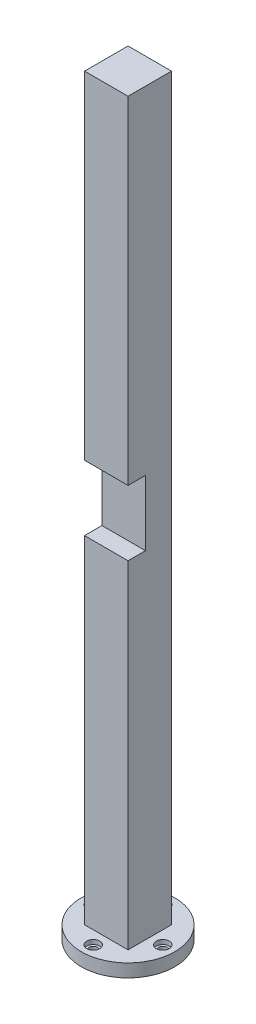
ISO-10303-21;
HEADER;
FILE_DESCRIPTION(('STEP AP214'),'2;1');
FILE_NAME('part.step','',(''),(''),'','','');
FILE_SCHEMA(('AUTOMOTIVE_DESIGN { 1 0 10303 214 1 1 1 1 }'));
ENDSEC;
DATA;
#1=APPLICATION_CONTEXT('core data for automotive mechanical design processes');
#2=APPLICATION_PROTOCOL_DEFINITION('international standard','automotive_design',2000,#1);
#3=PRODUCT_CONTEXT('',#1,'mechanical');
#4=PRODUCT('Part','Part','',(#3));
#5=PRODUCT_RELATED_PRODUCT_CATEGORY('part','',(#4));
#6=PRODUCT_DEFINITION_FORMATION('','',#4);
#7=PRODUCT_DEFINITION_CONTEXT('part definition',#1,'design');
#8=PRODUCT_DEFINITION('design','',#6,#7);
#9=PRODUCT_DEFINITION_SHAPE('','',#8);
#10=(LENGTH_UNIT() NAMED_UNIT(*) SI_UNIT(.MILLI.,.METRE.));
#11=(NAMED_UNIT(*) PLANE_ANGLE_UNIT() SI_UNIT($,.RADIAN.));
#12=(NAMED_UNIT(*) SI_UNIT($,.STERADIAN.) SOLID_ANGLE_UNIT());
#13=UNCERTAINTY_MEASURE_WITH_UNIT(LENGTH_MEASURE(1.E-05),#10,'distance_accuracy_value','');
#14=(GEOMETRIC_REPRESENTATION_CONTEXT(3) GLOBAL_UNCERTAINTY_ASSIGNED_CONTEXT((#13)) GLOBAL_UNIT_ASSIGNED_CONTEXT((#10,
#11,#12)) REPRESENTATION_CONTEXT('',''));
#15=CARTESIAN_POINT('',(0.,0.,0.));
#16=DIRECTION('',(0.,0.,1.));
#17=DIRECTION('',(1.,0.,0.));
#18=AXIS2_PLACEMENT_3D('',#15,#16,#17);
#19=CARTESIAN_POINT('',(0.,-88.,-8.));
#20=DIRECTION('',(0.,1.,0.));
#21=DIRECTION('',(0.,0.,1.));
#22=AXIS2_PLACEMENT_3D('',#19,#20,#21);
#23=CYLINDRICAL_SURFACE('',#22,1.);
#24=CARTESIAN_POINT('',(0.,-88.,-8.));
#25=DIRECTION('',(0.,1.,0.));
#26=DIRECTION('',(0.,0.,1.));
#27=AXIS2_PLACEMENT_3D('',#24,#25,#26);
#28=CIRCLE('',#27,1.);
#29=CARTESIAN_POINT('',(0.,-88.,-7.));
#30=VERTEX_POINT('',#29);
#31=EDGE_CURVE('E170',#30,#30,#28,.T.);
#32=ORIENTED_EDGE('',*,*,#31,.F.);
#33=EDGE_LOOP('',(#32));
#34=FACE_BOUND('',#33,.T.);
#35=CARTESIAN_POINT('',(0.,-86.,-8.));
#36=DIRECTION('',(0.,1.,0.));
#37=DIRECTION('',(0.,0.,1.));
#38=AXIS2_PLACEMENT_3D('',#35,#36,#37);
#39=CIRCLE('',#38,1.);
#40=CARTESIAN_POINT('',(0.,-86.,-7.));
#41=VERTEX_POINT('',#40);
#42=EDGE_CURVE('E43',#41,#41,#39,.F.);
#43=ORIENTED_EDGE('',*,*,#42,.F.);
#44=EDGE_LOOP('',(#43));
#45=FACE_BOUND('',#44,.T.);
#46=ADVANCED_FACE('F39',(#34,#45),#23,.F.);
#47=CARTESIAN_POINT('',(-8.,-88.,0.));
#48=DIRECTION('',(0.,1.,0.));
#49=DIRECTION('',(0.,0.,1.));
#50=AXIS2_PLACEMENT_3D('',#47,#48,#49);
#51=CYLINDRICAL_SURFACE('',#50,0.999999999999999);
#52=CARTESIAN_POINT('',(-8.,-88.,0.));
#53=DIRECTION('',(0.,1.,0.));
#54=DIRECTION('',(0.,0.,1.));
#55=AXIS2_PLACEMENT_3D('',#52,#53,#54);
#56=CIRCLE('',#55,0.999999999999999);
#57=CARTESIAN_POINT('',(-8.,-88.,0.999999999999943));
#58=VERTEX_POINT('',#57);
#59=EDGE_CURVE('E175',#58,#58,#56,.T.);
#60=ORIENTED_EDGE('',*,*,#59,.F.);
#61=EDGE_LOOP('',(#60));
#62=FACE_BOUND('',#61,.T.);
#63=CARTESIAN_POINT('',(-8.,-86.,0.));
#64=DIRECTION('',(0.,1.,0.));
#65=DIRECTION('',(0.,0.,1.));
#66=AXIS2_PLACEMENT_3D('',#63,#64,#65);
#67=CIRCLE('',#66,0.999999999999999);
#68=CARTESIAN_POINT('',(-8.,-86.,0.999999999999943));
#69=VERTEX_POINT('',#68);
#70=EDGE_CURVE('E163',#69,#69,#67,.F.);
#71=ORIENTED_EDGE('',*,*,#70,.F.);
#72=EDGE_LOOP('',(#71));
#73=FACE_BOUND('',#72,.T.);
#74=ADVANCED_FACE('F306',(#62,#73),#51,.F.);
#75=CARTESIAN_POINT('',(0.,-88.,8.));
#76=DIRECTION('',(0.,1.,0.));
#77=DIRECTION('',(0.,0.,1.));
#78=AXIS2_PLACEMENT_3D('',#75,#76,#77);
#79=CYLINDRICAL_SURFACE('',#78,1.);
#80=CARTESIAN_POINT('',(0.,-88.,8.));
#81=DIRECTION('',(0.,1.,0.));
#82=DIRECTION('',(0.,0.,1.));
#83=AXIS2_PLACEMENT_3D('',#80,#81,#82);
#84=CIRCLE('',#83,1.);
#85=CARTESIAN_POINT('',(0.,-88.,9.));
#86=VERTEX_POINT('',#85);
#87=EDGE_CURVE('E181',#86,#86,#84,.T.);
#88=ORIENTED_EDGE('',*,*,#87,.F.);
#89=EDGE_LOOP('',(#88));
#90=FACE_BOUND('',#89,.T.);
#91=CARTESIAN_POINT('',(0.,-86.,8.));
#92=DIRECTION('',(0.,1.,0.));
#93=DIRECTION('',(0.,0.,1.));
#94=AXIS2_PLACEMENT_3D('',#91,#92,#93);
#95=CIRCLE('',#94,1.);
#96=CARTESIAN_POINT('',(0.,-86.,9.));
#97=VERTEX_POINT('',#96);
#98=EDGE_CURVE('E159',#97,#97,#95,.F.);
#99=ORIENTED_EDGE('',*,*,#98,.F.);
#100=EDGE_LOOP('',(#99));
#101=FACE_BOUND('',#100,.T.);
#102=ADVANCED_FACE('F312',(#90,#101),#79,.F.);
#103=CARTESIAN_POINT('',(8.,-88.,0.));
#104=DIRECTION('',(0.,1.,0.));
#105=DIRECTION('',(0.,0.,1.));
#106=AXIS2_PLACEMENT_3D('',#103,#104,#105);
#107=CYLINDRICAL_SURFACE('',#106,1.);
#108=CARTESIAN_POINT('',(8.,-88.,0.));
#109=DIRECTION('',(0.,1.,0.));
#110=DIRECTION('',(0.,0.,1.));
#111=AXIS2_PLACEMENT_3D('',#108,#109,#110);
#112=CIRCLE('',#111,1.);
#113=CARTESIAN_POINT('',(8.,-88.,1.));
#114=VERTEX_POINT('',#113);
#115=EDGE_CURVE('E194',#114,#114,#112,.T.);
#116=ORIENTED_EDGE('',*,*,#115,.F.);
#117=EDGE_LOOP('',(#116));
#118=FACE_BOUND('',#117,.T.);
#119=CARTESIAN_POINT('',(8.,-86.,0.));
#120=DIRECTION('',(0.,1.,0.));
#121=DIRECTION('',(0.,0.,1.));
#122=AXIS2_PLACEMENT_3D('',#119,#120,#121);
#123=CIRCLE('',#122,1.);
#124=CARTESIAN_POINT('',(8.,-86.,1.));
#125=VERTEX_POINT('',#124);
#126=EDGE_CURVE('E155',#125,#125,#123,.F.);
#127=ORIENTED_EDGE('',*,*,#126,.F.);
#128=EDGE_LOOP('',(#127));
#129=FACE_BOUND('',#128,.T.);
#130=ADVANCED_FACE('F319',(#118,#129),#107,.F.);
#131=CARTESIAN_POINT('',(-5.,85.,5.));
#132=DIRECTION('',(0.,0.,-1.));
#133=DIRECTION('',(-1.,0.,0.));
#134=AXIS2_PLACEMENT_3D('',#131,#132,#133);
#135=PLANE('',#134);
#136=DIRECTION('',(0.,-1.,0.));
#137=VECTOR('',#136,1.);
#138=CARTESIAN_POINT('',(5.,85.,5.));
#139=LINE('',#138,#137);
#140=CARTESIAN_POINT('',(5.,-7.5,5.));
#141=VERTEX_POINT('',#140);
#142=CARTESIAN_POINT('',(5.,-85.,5.));
#143=VERTEX_POINT('',#142);
#144=EDGE_CURVE('E132',#141,#143,#139,.T.);
#145=ORIENTED_EDGE('',*,*,#144,.F.);
#146=DIRECTION('',(1.,0.,0.));
#147=VECTOR('',#146,1.);
#148=CARTESIAN_POINT('',(-5.,-7.5,5.));
#149=LINE('',#148,#147);
#150=CARTESIAN_POINT('',(-5.,-7.5,5.));
#151=VERTEX_POINT('',#150);
#152=EDGE_CURVE('E200',#151,#141,#149,.T.);
#153=ORIENTED_EDGE('',*,*,#152,.F.);
#154=DIRECTION('',(0.,-1.,0.));
#155=VECTOR('',#154,1.);
#156=CARTESIAN_POINT('',(-5.,85.,5.));
#157=LINE('',#156,#155);
#158=CARTESIAN_POINT('',(-5.,-85.,5.));
#159=VERTEX_POINT('',#158);
#160=EDGE_CURVE('E152',#151,#159,#157,.T.);
#161=ORIENTED_EDGE('',*,*,#160,.T.);
#162=DIRECTION('',(1.,0.,0.));
#163=VECTOR('',#162,1.);
#164=CARTESIAN_POINT('',(-5.,-85.,5.));
#165=LINE('',#164,#163);
#166=EDGE_CURVE('E144',#159,#143,#165,.T.);
#167=ORIENTED_EDGE('',*,*,#166,.T.);
#168=EDGE_LOOP('',(#145,#153,#161,#167));
#169=FACE_BOUND('',#168,.T.);
#170=ADVANCED_FACE('F322',(#169),#135,.F.);
#171=CARTESIAN_POINT('',(5.,85.,5.));
#172=DIRECTION('',(-1.,0.,0.));
#173=DIRECTION('',(0.,0.,1.));
#174=AXIS2_PLACEMENT_3D('',#171,#172,#173);
#175=PLANE('',#174);
#176=DIRECTION('',(0.,1.,0.));
#177=VECTOR('',#176,1.);
#178=CARTESIAN_POINT('',(5.,-7.5,0.999999999999999));
#179=LINE('',#178,#177);
#180=CARTESIAN_POINT('',(5.,-7.5,0.999999999999999));
#181=VERTEX_POINT('',#180);
#182=CARTESIAN_POINT('',(5.,7.5,0.999999999999999));
#183=VERTEX_POINT('',#182);
#184=EDGE_CURVE('E195',#181,#183,#179,.T.);
#185=ORIENTED_EDGE('',*,*,#184,.F.);
#186=DIRECTION('',(0.,0.,1.));
#187=VECTOR('',#186,1.);
#188=CARTESIAN_POINT('',(5.,-7.5,0.999999999999999));
#189=LINE('',#188,#187);
#190=EDGE_CURVE('E90',#181,#141,#189,.T.);
#191=ORIENTED_EDGE('',*,*,#190,.T.);
#192=ORIENTED_EDGE('',*,*,#144,.T.);
#193=DIRECTION('',(0.,0.,-1.));
#194=VECTOR('',#193,1.);
#195=CARTESIAN_POINT('',(5.,-85.,5.));
#196=LINE('',#195,#194);
#197=CARTESIAN_POINT('',(5.,-85.,-5.));
#198=VERTEX_POINT('',#197);
#199=EDGE_CURVE('E136',#143,#198,#196,.T.);
#200=ORIENTED_EDGE('',*,*,#199,.T.);
#201=DIRECTION('',(0.,-1.,0.));
#202=VECTOR('',#201,1.);
#203=CARTESIAN_POINT('',(5.,85.,-5.));
#204=LINE('',#203,#202);
#205=CARTESIAN_POINT('',(5.,85.,-5.));
#206=VERTEX_POINT('',#205);
#207=EDGE_CURVE('E11',#206,#198,#204,.T.);
#208=ORIENTED_EDGE('',*,*,#207,.F.);
#209=DIRECTION('',(0.,0.,-1.));
#210=VECTOR('',#209,1.);
#211=CARTESIAN_POINT('',(5.,85.,5.));
#212=LINE('',#211,#210);
#213=CARTESIAN_POINT('',(5.,85.,5.));
#214=VERTEX_POINT('',#213);
#215=EDGE_CURVE('E113',#214,#206,#212,.T.);
#216=ORIENTED_EDGE('',*,*,#215,.F.);
#217=CARTESIAN_POINT('',(5.,7.49999999999999,5.));
#218=VERTEX_POINT('',#217);
#219=EDGE_CURVE('E148',#214,#218,#139,.T.);
#220=ORIENTED_EDGE('',*,*,#219,.T.);
#221=DIRECTION('',(0.,0.,1.));
#222=VECTOR('',#221,1.);
#223=CARTESIAN_POINT('',(5.,7.5,0.999999999999999));
#224=LINE('',#223,#222);
#225=EDGE_CURVE('E57',#183,#218,#224,.T.);
#226=ORIENTED_EDGE('',*,*,#225,.F.);
#227=EDGE_LOOP('',(#185,#191,#192,#200,#208,#216,#220,#226));
#228=FACE_BOUND('',#227,.T.);
#229=ADVANCED_FACE('F41',(#228),#175,.F.);
#230=CARTESIAN_POINT('',(-5.,85.,-5.));
#231=DIRECTION('',(0.,0.,1.));
#232=DIRECTION('',(1.,0.,0.));
#233=AXIS2_PLACEMENT_3D('',#230,#231,#232);
#234=PLANE('',#233);
#235=DIRECTION('',(-1.,0.,0.));
#236=VECTOR('',#235,1.);
#237=CARTESIAN_POINT('',(-5.,-85.,-5.));
#238=LINE('',#237,#236);
#239=CARTESIAN_POINT('',(-5.,-85.,-5.));
#240=VERTEX_POINT('',#239);
#241=EDGE_CURVE('E120',#198,#240,#238,.T.);
#242=ORIENTED_EDGE('',*,*,#241,.T.);
#243=DIRECTION('',(0.,-1.,0.));
#244=VECTOR('',#243,1.);
#245=CARTESIAN_POINT('',(-5.,85.,-5.));
#246=LINE('',#245,#244);
#247=CARTESIAN_POINT('',(-5.,85.,-5.));
#248=VERTEX_POINT('',#247);
#249=EDGE_CURVE('E49',#248,#240,#246,.T.);
#250=ORIENTED_EDGE('',*,*,#249,.F.);
#251=DIRECTION('',(-1.,0.,0.));
#252=VECTOR('',#251,1.);
#253=CARTESIAN_POINT('',(-5.,85.,-5.));
#254=LINE('',#253,#252);
#255=EDGE_CURVE('E106',#206,#248,#254,.T.);
#256=ORIENTED_EDGE('',*,*,#255,.F.);
#257=ORIENTED_EDGE('',*,*,#207,.T.);
#258=EDGE_LOOP('',(#242,#250,#256,#257));
#259=FACE_BOUND('',#258,.T.);
#260=ADVANCED_FACE('F119',(#259),#234,.F.);
#261=CARTESIAN_POINT('',(-5.,85.,5.));
#262=DIRECTION('',(1.,0.,0.));
#263=DIRECTION('',(0.,0.,-1.));
#264=AXIS2_PLACEMENT_3D('',#261,#262,#263);
#265=PLANE('',#264);
#266=ORIENTED_EDGE('',*,*,#160,.F.);
#267=DIRECTION('',(0.,0.,1.));
#268=VECTOR('',#267,1.);
#269=CARTESIAN_POINT('',(-5.,-7.5,0.999999999999999));
#270=LINE('',#269,#268);
#271=CARTESIAN_POINT('',(-5.,-7.5,0.999999999999999));
#272=VERTEX_POINT('',#271);
#273=EDGE_CURVE('E216',#272,#151,#270,.T.);
#274=ORIENTED_EDGE('',*,*,#273,.F.);
#275=DIRECTION('',(0.,-1.,0.));
#276=VECTOR('',#275,1.);
#277=CARTESIAN_POINT('',(-5.,-7.5,0.999999999999999));
#278=LINE('',#277,#276);
#279=CARTESIAN_POINT('',(-5.,7.5,0.999999999999999));
#280=VERTEX_POINT('',#279);
#281=EDGE_CURVE('E204',#280,#272,#278,.T.);
#282=ORIENTED_EDGE('',*,*,#281,.F.);
#283=DIRECTION('',(0.,0.,1.));
#284=VECTOR('',#283,1.);
#285=CARTESIAN_POINT('',(-5.,7.5,0.999999999999999));
#286=LINE('',#285,#284);
#287=CARTESIAN_POINT('',(-5.,7.5,5.));
#288=VERTEX_POINT('',#287);
#289=EDGE_CURVE('E219',#280,#288,#286,.T.);
#290=ORIENTED_EDGE('',*,*,#289,.T.);
#291=CARTESIAN_POINT('',(-5.,85.,5.));
#292=VERTEX_POINT('',#291);
#293=EDGE_CURVE('E123',#292,#288,#157,.T.);
#294=ORIENTED_EDGE('',*,*,#293,.F.);
#295=DIRECTION('',(0.,0.,1.));
#296=VECTOR('',#295,1.);
#297=CARTESIAN_POINT('',(-5.,85.,5.));
#298=LINE('',#297,#296);
#299=EDGE_CURVE('E110',#248,#292,#298,.T.);
#300=ORIENTED_EDGE('',*,*,#299,.F.);
#301=ORIENTED_EDGE('',*,*,#249,.T.);
#302=DIRECTION('',(0.,0.,1.));
#303=VECTOR('',#302,1.);
#304=CARTESIAN_POINT('',(-5.,-85.,5.));
#305=LINE('',#304,#303);
#306=EDGE_CURVE('E79',#240,#159,#305,.T.);
#307=ORIENTED_EDGE('',*,*,#306,.T.);
#308=EDGE_LOOP('',(#266,#274,#282,#290,#294,#300,#301,#307));
#309=FACE_BOUND('',#308,.T.);
#310=ADVANCED_FACE('F126',(#309),#265,.F.);
#311=ORIENTED_EDGE('',*,*,#293,.T.);
#312=DIRECTION('',(-1.,0.,0.));
#313=VECTOR('',#312,1.);
#314=CARTESIAN_POINT('',(-5.,7.5,5.));
#315=LINE('',#314,#313);
#316=EDGE_CURVE('E189',#218,#288,#315,.T.);
#317=ORIENTED_EDGE('',*,*,#316,.F.);
#318=ORIENTED_EDGE('',*,*,#219,.F.);
#319=DIRECTION('',(1.,0.,0.));
#320=VECTOR('',#319,1.);
#321=CARTESIAN_POINT('',(-5.,85.,5.));
#322=LINE('',#321,#320);
#323=EDGE_CURVE('E66',#292,#214,#322,.T.);
#324=ORIENTED_EDGE('',*,*,#323,.F.);
#325=EDGE_LOOP('',(#311,#317,#318,#324));
#326=FACE_BOUND('',#325,.T.);
#327=ADVANCED_FACE('F460',(#326),#135,.F.);
#328=CARTESIAN_POINT('',(0.,85.,0.));
#329=DIRECTION('',(0.,-1.,0.));
#330=DIRECTION('',(0.,0.,-1.));
#331=AXIS2_PLACEMENT_3D('',#328,#329,#330);
#332=PLANE('',#331);
#333=ORIENTED_EDGE('',*,*,#215,.T.);
#334=ORIENTED_EDGE('',*,*,#255,.T.);
#335=ORIENTED_EDGE('',*,*,#299,.T.);
#336=ORIENTED_EDGE('',*,*,#323,.T.);
#337=EDGE_LOOP('',(#333,#334,#335,#336));
#338=FACE_BOUND('',#337,.T.);
#339=ADVANCED_FACE('F108',(#338),#332,.F.);
#340=CARTESIAN_POINT('',(-5.,-7.5,0.999999999999999));
#341=DIRECTION('',(0.,-1.,0.));
#342=DIRECTION('',(0.,0.,-1.));
#343=AXIS2_PLACEMENT_3D('',#340,#341,#342);
#344=PLANE('',#343);
#345=ORIENTED_EDGE('',*,*,#152,.T.);
#346=ORIENTED_EDGE('',*,*,#190,.F.);
#347=DIRECTION('',(1.,0.,0.));
#348=VECTOR('',#347,1.);
#349=CARTESIAN_POINT('',(-5.,-7.5,0.999999999999999));
#350=LINE('',#349,#348);
#351=EDGE_CURVE('E207',#272,#181,#350,.T.);
#352=ORIENTED_EDGE('',*,*,#351,.F.);
#353=ORIENTED_EDGE('',*,*,#273,.T.);
#354=EDGE_LOOP('',(#345,#346,#352,#353));
#355=FACE_BOUND('',#354,.T.);
#356=ADVANCED_FACE('F443',(#355),#344,.F.);
#357=CARTESIAN_POINT('',(-5.,7.5,0.999999999999999));
#358=DIRECTION('',(0.,1.,0.));
#359=DIRECTION('',(0.,0.,1.));
#360=AXIS2_PLACEMENT_3D('',#357,#358,#359);
#361=PLANE('',#360);
#362=ORIENTED_EDGE('',*,*,#316,.T.);
#363=ORIENTED_EDGE('',*,*,#289,.F.);
#364=DIRECTION('',(-1.,0.,0.));
#365=VECTOR('',#364,1.);
#366=CARTESIAN_POINT('',(-5.,7.5,0.999999999999999));
#367=LINE('',#366,#365);
#368=EDGE_CURVE('E199',#183,#280,#367,.T.);
#369=ORIENTED_EDGE('',*,*,#368,.F.);
#370=ORIENTED_EDGE('',*,*,#225,.T.);
#371=EDGE_LOOP('',(#362,#363,#369,#370));
#372=FACE_BOUND('',#371,.T.);
#373=ADVANCED_FACE('F301',(#372),#361,.F.);
#374=CARTESIAN_POINT('',(0.,0.,0.999999999999999));
#375=DIRECTION('',(0.,0.,-1.));
#376=DIRECTION('',(-1.,0.,0.));
#377=AXIS2_PLACEMENT_3D('',#374,#375,#376);
#378=PLANE('',#377);
#379=ORIENTED_EDGE('',*,*,#184,.T.);
#380=ORIENTED_EDGE('',*,*,#368,.T.);
#381=ORIENTED_EDGE('',*,*,#281,.T.);
#382=ORIENTED_EDGE('',*,*,#351,.T.);
#383=EDGE_LOOP('',(#379,#380,#381,#382));
#384=FACE_BOUND('',#383,.T.);
#385=ADVANCED_FACE('F291',(#384),#378,.F.);
#386=CARTESIAN_POINT('',(0.,-88.,0.));
#387=DIRECTION('',(0.,1.,0.));
#388=DIRECTION('',(0.,0.,1.));
#389=AXIS2_PLACEMENT_3D('',#386,#387,#388);
#390=CYLINDRICAL_SURFACE('',#389,10.75);
#391=CARTESIAN_POINT('',(0.,-88.,0.));
#392=DIRECTION('',(0.,-1.,0.));
#393=DIRECTION('',(0.,0.,-1.));
#394=AXIS2_PLACEMENT_3D('',#391,#392,#393);
#395=CIRCLE('',#394,10.75);
#396=CARTESIAN_POINT('',(0.,-88.,-10.75));
#397=VERTEX_POINT('',#396);
#398=EDGE_CURVE('E185',#397,#397,#395,.T.);
#399=ORIENTED_EDGE('',*,*,#398,.F.);
#400=EDGE_LOOP('',(#399));
#401=FACE_BOUND('',#400,.T.);
#402=CARTESIAN_POINT('',(0.,-85.,0.));
#403=DIRECTION('',(0.,-1.,0.));
#404=DIRECTION('',(0.,0.,-1.));
#405=AXIS2_PLACEMENT_3D('',#402,#403,#404);
#406=CIRCLE('',#405,10.75);
#407=CARTESIAN_POINT('',(0.,-85.,-10.75));
#408=VERTEX_POINT('',#407);
#409=EDGE_CURVE('E190',#408,#408,#406,.T.);
#410=ORIENTED_EDGE('',*,*,#409,.T.);
#411=EDGE_LOOP('',(#410));
#412=FACE_BOUND('',#411,.T.);
#413=ADVANCED_FACE('F289',(#401,#412),#390,.T.);
#414=CARTESIAN_POINT('',(0.,-88.,0.));
#415=DIRECTION('',(0.,-1.,0.));
#416=DIRECTION('',(0.,0.,-1.));
#417=AXIS2_PLACEMENT_3D('',#414,#415,#416);
#418=PLANE('',#417);
#419=ORIENTED_EDGE('',*,*,#115,.T.);
#420=EDGE_LOOP('',(#419));
#421=FACE_BOUND('',#420,.T.);
#422=ORIENTED_EDGE('',*,*,#87,.T.);
#423=EDGE_LOOP('',(#422));
#424=FACE_BOUND('',#423,.T.);
#425=ORIENTED_EDGE('',*,*,#59,.T.);
#426=EDGE_LOOP('',(#425));
#427=FACE_BOUND('',#426,.T.);
#428=ORIENTED_EDGE('',*,*,#31,.T.);
#429=EDGE_LOOP('',(#428));
#430=FACE_BOUND('',#429,.T.);
#431=ORIENTED_EDGE('',*,*,#398,.T.);
#432=EDGE_LOOP('',(#431));
#433=FACE_BOUND('',#432,.T.);
#434=ADVANCED_FACE('F277',(#421,#424,#427,#430,#433),#418,.T.);
#435=CARTESIAN_POINT('',(0.,-85.,0.));
#436=DIRECTION('',(0.,-1.,0.));
#437=DIRECTION('',(0.,0.,-1.));
#438=AXIS2_PLACEMENT_3D('',#435,#436,#437);
#439=PLANE('',#438);
#440=CARTESIAN_POINT('',(8.,-85.,0.));
#441=DIRECTION('',(0.,1.,0.));
#442=DIRECTION('',(0.,0.,1.));
#443=AXIS2_PLACEMENT_3D('',#440,#441,#442);
#444=CIRCLE('',#443,1.5);
#445=CARTESIAN_POINT('',(8.,-85.,1.5));
#446=VERTEX_POINT('',#445);
#447=EDGE_CURVE('E256',#446,#446,#444,.T.);
#448=ORIENTED_EDGE('',*,*,#447,.F.);
#449=EDGE_LOOP('',(#448));
#450=FACE_BOUND('',#449,.T.);
#451=CARTESIAN_POINT('',(0.,-85.,8.));
#452=DIRECTION('',(0.,1.,0.));
#453=DIRECTION('',(0.,0.,1.));
#454=AXIS2_PLACEMENT_3D('',#451,#452,#453);
#455=CIRCLE('',#454,1.5);
#456=CARTESIAN_POINT('',(0.,-85.,9.5));
#457=VERTEX_POINT('',#456);
#458=EDGE_CURVE('E248',#457,#457,#455,.T.);
#459=ORIENTED_EDGE('',*,*,#458,.F.);
#460=EDGE_LOOP('',(#459));
#461=FACE_BOUND('',#460,.T.);
#462=CARTESIAN_POINT('',(-8.,-85.,0.));
#463=DIRECTION('',(0.,1.,0.));
#464=DIRECTION('',(0.,0.,1.));
#465=AXIS2_PLACEMENT_3D('',#462,#463,#464);
#466=CIRCLE('',#465,1.5);
#467=CARTESIAN_POINT('',(-8.,-85.,1.49999999999994));
#468=VERTEX_POINT('',#467);
#469=EDGE_CURVE('E240',#468,#468,#466,.T.);
#470=ORIENTED_EDGE('',*,*,#469,.F.);
#471=EDGE_LOOP('',(#470));
#472=FACE_BOUND('',#471,.T.);
#473=CARTESIAN_POINT('',(0.,-85.,-8.));
#474=DIRECTION('',(0.,1.,0.));
#475=DIRECTION('',(0.,0.,1.));
#476=AXIS2_PLACEMENT_3D('',#473,#474,#475);
#477=CIRCLE('',#476,1.5);
#478=CARTESIAN_POINT('',(0.,-85.,-6.5));
#479=VERTEX_POINT('',#478);
#480=EDGE_CURVE('E232',#479,#479,#477,.T.);
#481=ORIENTED_EDGE('',*,*,#480,.F.);
#482=EDGE_LOOP('',(#481));
#483=FACE_BOUND('',#482,.T.);
#484=ORIENTED_EDGE('',*,*,#199,.F.);
#485=ORIENTED_EDGE('',*,*,#166,.F.);
#486=ORIENTED_EDGE('',*,*,#306,.F.);
#487=ORIENTED_EDGE('',*,*,#241,.F.);
#488=EDGE_LOOP('',(#484,#485,#486,#487));
#489=FACE_BOUND('',#488,.T.);
#490=ORIENTED_EDGE('',*,*,#409,.F.);
#491=EDGE_LOOP('',(#490));
#492=FACE_BOUND('',#491,.T.);
#493=ADVANCED_FACE('F274',(#450,#461,#472,#483,#489,#492),#439,.F.);
#494=CARTESIAN_POINT('',(8.,-86.,0.));
#495=DIRECTION('',(0.,1.,0.));
#496=DIRECTION('',(0.,0.,1.));
#497=AXIS2_PLACEMENT_3D('',#494,#495,#496);
#498=PLANE('',#497);
#499=CARTESIAN_POINT('',(8.,-86.,0.));
#500=DIRECTION('',(0.,1.,0.));
#501=DIRECTION('',(0.,0.,1.));
#502=AXIS2_PLACEMENT_3D('',#499,#500,#501);
#503=CIRCLE('',#502,1.5);
#504=CARTESIAN_POINT('',(8.,-86.,1.5));
#505=VERTEX_POINT('',#504);
#506=EDGE_CURVE('E160',#505,#505,#503,.T.);
#507=ORIENTED_EDGE('',*,*,#506,.T.);
#508=EDGE_LOOP('',(#507));
#509=FACE_BOUND('',#508,.T.);
#510=ORIENTED_EDGE('',*,*,#126,.T.);
#511=EDGE_LOOP('',(#510));
#512=FACE_BOUND('',#511,.T.);
#513=ADVANCED_FACE('F264',(#509,#512),#498,.T.);
#514=CARTESIAN_POINT('',(8.,-86.,0.));
#515=DIRECTION('',(0.,1.,0.));
#516=DIRECTION('',(0.,0.,1.));
#517=AXIS2_PLACEMENT_3D('',#514,#515,#516);
#518=CYLINDRICAL_SURFACE('',#517,1.5);
#519=ORIENTED_EDGE('',*,*,#506,.F.);
#520=EDGE_LOOP('',(#519));
#521=FACE_BOUND('',#520,.T.);
#522=ORIENTED_EDGE('',*,*,#447,.T.);
#523=EDGE_LOOP('',(#522));
#524=FACE_BOUND('',#523,.T.);
#525=ADVANCED_FACE('F267',(#521,#524),#518,.F.);
#526=CARTESIAN_POINT('',(0.,-86.,8.));
#527=DIRECTION('',(0.,1.,0.));
#528=DIRECTION('',(0.,0.,1.));
#529=AXIS2_PLACEMENT_3D('',#526,#527,#528);
#530=PLANE('',#529);
#531=CARTESIAN_POINT('',(0.,-86.,8.));
#532=DIRECTION('',(0.,1.,0.));
#533=DIRECTION('',(0.,0.,1.));
#534=AXIS2_PLACEMENT_3D('',#531,#532,#533);
#535=CIRCLE('',#534,1.5);
#536=CARTESIAN_POINT('',(0.,-86.,9.5));
#537=VERTEX_POINT('',#536);
#538=EDGE_CURVE('E252',#537,#537,#535,.T.);
#539=ORIENTED_EDGE('',*,*,#538,.T.);
#540=EDGE_LOOP('',(#539));
#541=FACE_BOUND('',#540,.T.);
#542=ORIENTED_EDGE('',*,*,#98,.T.);
#543=EDGE_LOOP('',(#542));
#544=FACE_BOUND('',#543,.T.);
#545=ADVANCED_FACE('F270',(#541,#544),#530,.T.);
#546=CARTESIAN_POINT('',(0.,-86.,8.));
#547=DIRECTION('',(0.,1.,0.));
#548=DIRECTION('',(0.,0.,1.));
#549=AXIS2_PLACEMENT_3D('',#546,#547,#548);
#550=CYLINDRICAL_SURFACE('',#549,1.5);
#551=ORIENTED_EDGE('',*,*,#538,.F.);
#552=EDGE_LOOP('',(#551));
#553=FACE_BOUND('',#552,.T.);
#554=ORIENTED_EDGE('',*,*,#458,.T.);
#555=EDGE_LOOP('',(#554));
#556=FACE_BOUND('',#555,.T.);
#557=ADVANCED_FACE('F339',(#553,#556),#550,.F.);
#558=CARTESIAN_POINT('',(-8.,-86.,0.));
#559=DIRECTION('',(0.,1.,0.));
#560=DIRECTION('',(0.,0.,1.));
#561=AXIS2_PLACEMENT_3D('',#558,#559,#560);
#562=PLANE('',#561);
#563=CARTESIAN_POINT('',(-8.,-86.,0.));
#564=DIRECTION('',(0.,1.,0.));
#565=DIRECTION('',(0.,0.,1.));
#566=AXIS2_PLACEMENT_3D('',#563,#564,#565);
#567=CIRCLE('',#566,1.5);
#568=CARTESIAN_POINT('',(-8.,-86.,1.49999999999994));
#569=VERTEX_POINT('',#568);
#570=EDGE_CURVE('E244',#569,#569,#567,.T.);
#571=ORIENTED_EDGE('',*,*,#570,.T.);
#572=EDGE_LOOP('',(#571));
#573=FACE_BOUND('',#572,.T.);
#574=ORIENTED_EDGE('',*,*,#70,.T.);
#575=EDGE_LOOP('',(#574));
#576=FACE_BOUND('',#575,.T.);
#577=ADVANCED_FACE('F335',(#573,#576),#562,.T.);
#578=CARTESIAN_POINT('',(-8.,-86.,0.));
#579=DIRECTION('',(0.,1.,0.));
#580=DIRECTION('',(0.,0.,1.));
#581=AXIS2_PLACEMENT_3D('',#578,#579,#580);
#582=CYLINDRICAL_SURFACE('',#581,1.5);
#583=ORIENTED_EDGE('',*,*,#570,.F.);
#584=EDGE_LOOP('',(#583));
#585=FACE_BOUND('',#584,.T.);
#586=ORIENTED_EDGE('',*,*,#469,.T.);
#587=EDGE_LOOP('',(#586));
#588=FACE_BOUND('',#587,.T.);
#589=ADVANCED_FACE('F331',(#585,#588),#582,.F.);
#590=CARTESIAN_POINT('',(0.,-86.,-8.));
#591=DIRECTION('',(0.,1.,0.));
#592=DIRECTION('',(0.,0.,1.));
#593=AXIS2_PLACEMENT_3D('',#590,#591,#592);
#594=PLANE('',#593);
#595=CARTESIAN_POINT('',(0.,-86.,-8.));
#596=DIRECTION('',(0.,1.,0.));
#597=DIRECTION('',(0.,0.,1.));
#598=AXIS2_PLACEMENT_3D('',#595,#596,#597);
#599=CIRCLE('',#598,1.5);
#600=CARTESIAN_POINT('',(0.,-86.,-6.5));
#601=VERTEX_POINT('',#600);
#602=EDGE_CURVE('E236',#601,#601,#599,.T.);
#603=ORIENTED_EDGE('',*,*,#602,.T.);
#604=EDGE_LOOP('',(#603));
#605=FACE_BOUND('',#604,.T.);
#606=ORIENTED_EDGE('',*,*,#42,.T.);
#607=EDGE_LOOP('',(#606));
#608=FACE_BOUND('',#607,.T.);
#609=ADVANCED_FACE('F327',(#605,#608),#594,.T.);
#610=CARTESIAN_POINT('',(0.,-86.,-8.));
#611=DIRECTION('',(0.,1.,0.));
#612=DIRECTION('',(0.,0.,1.));
#613=AXIS2_PLACEMENT_3D('',#610,#611,#612);
#614=CYLINDRICAL_SURFACE('',#613,1.5);
#615=ORIENTED_EDGE('',*,*,#602,.F.);
#616=EDGE_LOOP('',(#615));
#617=FACE_BOUND('',#616,.T.);
#618=ORIENTED_EDGE('',*,*,#480,.T.);
#619=EDGE_LOOP('',(#618));
#620=FACE_BOUND('',#619,.T.);
#621=ADVANCED_FACE('F324',(#617,#620),#614,.F.);
#622=CLOSED_SHELL('',(#46,#74,#102,#130,#170,#229,#260,#310,#327,#339,#356,#373,#385,#413,#434,
#493,#513,#525,#545,#557,#577,#589,#609,#621));
#623=MANIFOLD_SOLID_BREP('B2',#622);
#624=ADVANCED_BREP_SHAPE_REPRESENTATION('',(#18,#623),#14);
#625=SHAPE_DEFINITION_REPRESENTATION(#9,#624);
ENDSEC;
END-ISO-10303-21;
